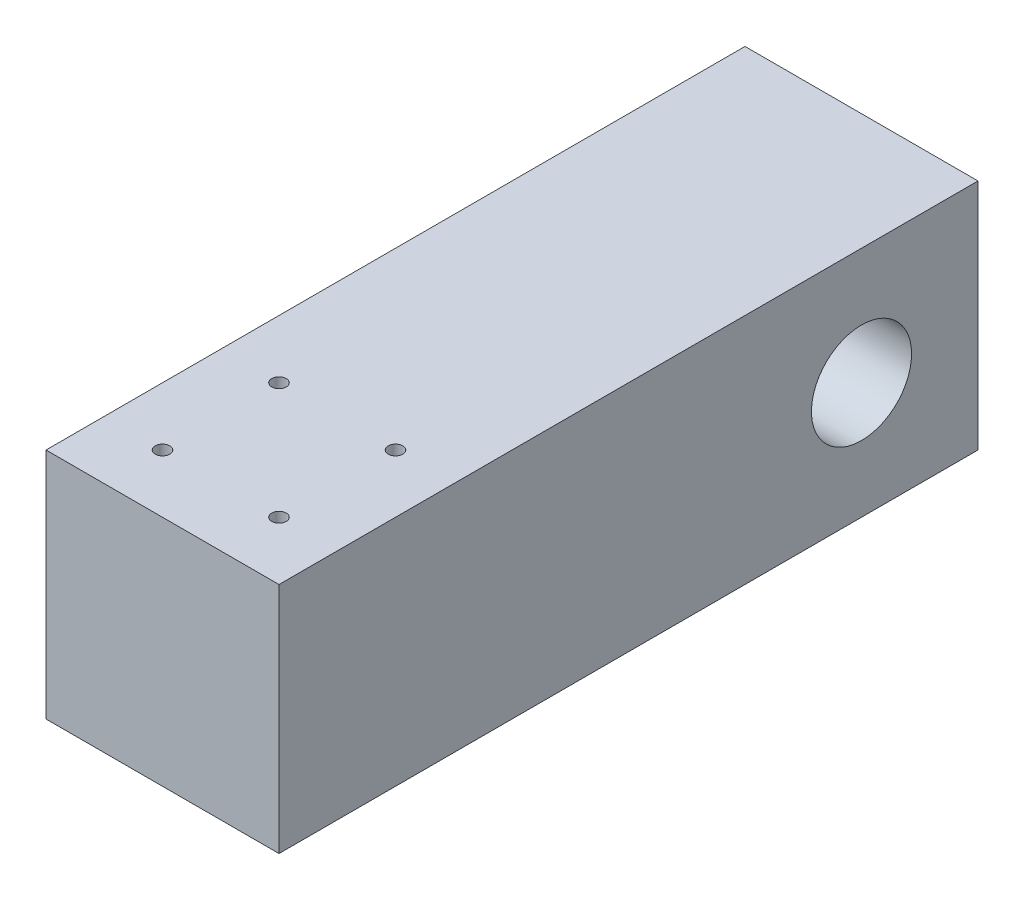
ISO-10303-21;
HEADER;
FILE_DESCRIPTION(('STEP AP214'),'2;1');
FILE_NAME('part.step','',(''),(''),'','','');
FILE_SCHEMA(('AUTOMOTIVE_DESIGN { 1 0 10303 214 1 1 1 1 }'));
ENDSEC;
DATA;
#1=APPLICATION_CONTEXT('core data for automotive mechanical design processes');
#2=APPLICATION_PROTOCOL_DEFINITION('international standard','automotive_design',2000,#1);
#3=PRODUCT_CONTEXT('',#1,'mechanical');
#4=PRODUCT('Part','Part','',(#3));
#5=PRODUCT_RELATED_PRODUCT_CATEGORY('part','',(#4));
#6=PRODUCT_DEFINITION_FORMATION('','',#4);
#7=PRODUCT_DEFINITION_CONTEXT('part definition',#1,'design');
#8=PRODUCT_DEFINITION('design','',#6,#7);
#9=PRODUCT_DEFINITION_SHAPE('','',#8);
#10=(LENGTH_UNIT() NAMED_UNIT(*) SI_UNIT(.MILLI.,.METRE.));
#11=(NAMED_UNIT(*) PLANE_ANGLE_UNIT() SI_UNIT($,.RADIAN.));
#12=(NAMED_UNIT(*) SI_UNIT($,.STERADIAN.) SOLID_ANGLE_UNIT());
#13=UNCERTAINTY_MEASURE_WITH_UNIT(LENGTH_MEASURE(1.E-05),#10,'distance_accuracy_value','');
#14=(GEOMETRIC_REPRESENTATION_CONTEXT(3) GLOBAL_UNCERTAINTY_ASSIGNED_CONTEXT((#13)) GLOBAL_UNIT_ASSIGNED_CONTEXT((#10,
#11,#12)) REPRESENTATION_CONTEXT('',''));
#15=CARTESIAN_POINT('',(0.,0.,0.));
#16=DIRECTION('',(0.,0.,1.));
#17=DIRECTION('',(1.,0.,0.));
#18=AXIS2_PLACEMENT_3D('',#15,#16,#17);
#19=CARTESIAN_POINT('',(50.8,0.,0.));
#20=DIRECTION('',(0.,0.,-1.));
#21=DIRECTION('',(-1.,0.,0.));
#22=AXIS2_PLACEMENT_3D('',#19,#20,#21);
#23=PLANE('',#22);
#24=DIRECTION('',(0.,-1.,0.));
#25=VECTOR('',#24,1.);
#26=CARTESIAN_POINT('',(0.,0.,0.));
#27=LINE('',#26,#25);
#28=CARTESIAN_POINT('',(0.,50.8,0.));
#29=VERTEX_POINT('',#28);
#30=CARTESIAN_POINT('',(0.,0.,0.));
#31=VERTEX_POINT('',#30);
#32=EDGE_CURVE('E97',#29,#31,#27,.T.);
#33=ORIENTED_EDGE('',*,*,#32,.T.);
#34=DIRECTION('',(-1.,0.,0.));
#35=VECTOR('',#34,1.);
#36=CARTESIAN_POINT('',(50.8,0.,0.));
#37=LINE('',#36,#35);
#38=CARTESIAN_POINT('',(50.8,0.,0.));
#39=VERTEX_POINT('',#38);
#40=EDGE_CURVE('E11',#39,#31,#37,.T.);
#41=ORIENTED_EDGE('',*,*,#40,.F.);
#42=DIRECTION('',(0.,-1.,0.));
#43=VECTOR('',#42,1.);
#44=CARTESIAN_POINT('',(50.8,0.,0.));
#45=LINE('',#44,#43);
#46=CARTESIAN_POINT('',(50.8,50.8,0.));
#47=VERTEX_POINT('',#46);
#48=EDGE_CURVE('E85',#47,#39,#45,.T.);
#49=ORIENTED_EDGE('',*,*,#48,.F.);
#50=DIRECTION('',(-1.,0.,0.));
#51=VECTOR('',#50,1.);
#52=CARTESIAN_POINT('',(50.8,50.8,0.));
#53=LINE('',#52,#51);
#54=EDGE_CURVE('E93',#47,#29,#53,.T.);
#55=ORIENTED_EDGE('',*,*,#54,.T.);
#56=EDGE_LOOP('',(#33,#41,#49,#55));
#57=FACE_BOUND('',#56,.T.);
#58=ADVANCED_FACE('F34',(#57),#23,.F.);
#59=CARTESIAN_POINT('',(50.8,0.,0.));
#60=DIRECTION('',(0.,1.,0.));
#61=DIRECTION('',(0.,0.,1.));
#62=AXIS2_PLACEMENT_3D('',#59,#60,#61);
#63=PLANE('',#62);
#64=CARTESIAN_POINT('',(38.1,0.,-38.1));
#65=DIRECTION('',(0.,1.,0.));
#66=DIRECTION('',(0.,0.,1.));
#67=AXIS2_PLACEMENT_3D('',#64,#65,#66);
#68=CIRCLE('',#67,1.5875);
#69=CARTESIAN_POINT('',(38.1,0.,-36.5125));
#70=VERTEX_POINT('',#69);
#71=EDGE_CURVE('E120',#70,#70,#68,.T.);
#72=ORIENTED_EDGE('',*,*,#71,.T.);
#73=EDGE_LOOP('',(#72));
#74=FACE_BOUND('',#73,.T.);
#75=CARTESIAN_POINT('',(12.7,0.,-12.7));
#76=DIRECTION('',(0.,1.,0.));
#77=DIRECTION('',(0.,0.,1.));
#78=AXIS2_PLACEMENT_3D('',#75,#76,#77);
#79=CIRCLE('',#78,1.5875);
#80=CARTESIAN_POINT('',(12.7,0.,-11.1125));
#81=VERTEX_POINT('',#80);
#82=EDGE_CURVE('E126',#81,#81,#79,.T.);
#83=ORIENTED_EDGE('',*,*,#82,.T.);
#84=EDGE_LOOP('',(#83));
#85=FACE_BOUND('',#84,.T.);
#86=CARTESIAN_POINT('',(38.1,0.,-12.7));
#87=DIRECTION('',(0.,1.,0.));
#88=DIRECTION('',(0.,0.,1.));
#89=AXIS2_PLACEMENT_3D('',#86,#87,#88);
#90=CIRCLE('',#89,1.5875);
#91=CARTESIAN_POINT('',(38.1,0.,-11.1125));
#92=VERTEX_POINT('',#91);
#93=EDGE_CURVE('E127',#92,#92,#90,.T.);
#94=ORIENTED_EDGE('',*,*,#93,.T.);
#95=EDGE_LOOP('',(#94));
#96=FACE_BOUND('',#95,.T.);
#97=CARTESIAN_POINT('',(12.7,0.,-38.1));
#98=DIRECTION('',(0.,1.,0.));
#99=DIRECTION('',(0.,0.,1.));
#100=AXIS2_PLACEMENT_3D('',#97,#98,#99);
#101=CIRCLE('',#100,1.5875);
#102=CARTESIAN_POINT('',(12.7,0.,-36.5125));
#103=VERTEX_POINT('',#102);
#104=EDGE_CURVE('E114',#103,#103,#101,.T.);
#105=ORIENTED_EDGE('',*,*,#104,.T.);
#106=EDGE_LOOP('',(#105));
#107=FACE_BOUND('',#106,.T.);
#108=DIRECTION('',(0.,0.,-1.));
#109=VECTOR('',#108,1.);
#110=CARTESIAN_POINT('',(0.,0.,0.));
#111=LINE('',#110,#109);
#112=CARTESIAN_POINT('',(0.,0.,-152.4));
#113=VERTEX_POINT('',#112);
#114=EDGE_CURVE('E89',#31,#113,#111,.T.);
#115=ORIENTED_EDGE('',*,*,#114,.T.);
#116=DIRECTION('',(-1.,0.,0.));
#117=VECTOR('',#116,1.);
#118=CARTESIAN_POINT('',(50.8,0.,-152.4));
#119=LINE('',#118,#117);
#120=CARTESIAN_POINT('',(50.8,0.,-152.4));
#121=VERTEX_POINT('',#120);
#122=EDGE_CURVE('E42',#121,#113,#119,.T.);
#123=ORIENTED_EDGE('',*,*,#122,.F.);
#124=DIRECTION('',(0.,0.,-1.));
#125=VECTOR('',#124,1.);
#126=CARTESIAN_POINT('',(50.8,0.,0.));
#127=LINE('',#126,#125);
#128=EDGE_CURVE('E80',#39,#121,#127,.T.);
#129=ORIENTED_EDGE('',*,*,#128,.F.);
#130=ORIENTED_EDGE('',*,*,#40,.T.);
#131=EDGE_LOOP('',(#115,#123,#129,#130));
#132=FACE_BOUND('',#131,.T.);
#133=ADVANCED_FACE('F88',(#74,#85,#96,#107,#132),#63,.F.);
#134=CARTESIAN_POINT('',(50.8,0.,-152.4));
#135=DIRECTION('',(0.,0.,1.));
#136=DIRECTION('',(1.,0.,0.));
#137=AXIS2_PLACEMENT_3D('',#134,#135,#136);
#138=PLANE('',#137);
#139=DIRECTION('',(0.,1.,0.));
#140=VECTOR('',#139,1.);
#141=CARTESIAN_POINT('',(0.,0.,-152.4));
#142=LINE('',#141,#140);
#143=CARTESIAN_POINT('',(0.,50.8,-152.4));
#144=VERTEX_POINT('',#143);
#145=EDGE_CURVE('E67',#113,#144,#142,.T.);
#146=ORIENTED_EDGE('',*,*,#145,.T.);
#147=DIRECTION('',(-1.,0.,0.));
#148=VECTOR('',#147,1.);
#149=CARTESIAN_POINT('',(50.8,50.8,-152.4));
#150=LINE('',#149,#148);
#151=CARTESIAN_POINT('',(50.8,50.8,-152.4));
#152=VERTEX_POINT('',#151);
#153=EDGE_CURVE('E90',#152,#144,#150,.T.);
#154=ORIENTED_EDGE('',*,*,#153,.F.);
#155=DIRECTION('',(0.,1.,0.));
#156=VECTOR('',#155,1.);
#157=CARTESIAN_POINT('',(50.8,0.,-152.4));
#158=LINE('',#157,#156);
#159=EDGE_CURVE('E83',#121,#152,#158,.T.);
#160=ORIENTED_EDGE('',*,*,#159,.F.);
#161=ORIENTED_EDGE('',*,*,#122,.T.);
#162=EDGE_LOOP('',(#146,#154,#160,#161));
#163=FACE_BOUND('',#162,.T.);
#164=ADVANCED_FACE('F91',(#163),#138,.F.);
#165=CARTESIAN_POINT('',(50.8,50.8,0.));
#166=DIRECTION('',(0.,-1.,0.));
#167=DIRECTION('',(0.,0.,-1.));
#168=AXIS2_PLACEMENT_3D('',#165,#166,#167);
#169=PLANE('',#168);
#170=CARTESIAN_POINT('',(38.1,50.8,-38.1));
#171=DIRECTION('',(0.,1.,0.));
#172=DIRECTION('',(0.,0.,1.));
#173=AXIS2_PLACEMENT_3D('',#170,#171,#172);
#174=CIRCLE('',#173,1.5875);
#175=CARTESIAN_POINT('',(38.1,50.8,-36.5125));
#176=VERTEX_POINT('',#175);
#177=EDGE_CURVE('E130',#176,#176,#174,.T.);
#178=ORIENTED_EDGE('',*,*,#177,.F.);
#179=EDGE_LOOP('',(#178));
#180=FACE_BOUND('',#179,.T.);
#181=CARTESIAN_POINT('',(12.7,50.8,-12.7));
#182=DIRECTION('',(0.,1.,0.));
#183=DIRECTION('',(0.,0.,1.));
#184=AXIS2_PLACEMENT_3D('',#181,#182,#183);
#185=CIRCLE('',#184,1.5875);
#186=CARTESIAN_POINT('',(12.7,50.8,-11.1125));
#187=VERTEX_POINT('',#186);
#188=EDGE_CURVE('E123',#187,#187,#185,.T.);
#189=ORIENTED_EDGE('',*,*,#188,.F.);
#190=EDGE_LOOP('',(#189));
#191=FACE_BOUND('',#190,.T.);
#192=CARTESIAN_POINT('',(38.1,50.8,-12.7));
#193=DIRECTION('',(0.,1.,0.));
#194=DIRECTION('',(0.,0.,1.));
#195=AXIS2_PLACEMENT_3D('',#192,#193,#194);
#196=CIRCLE('',#195,1.5875);
#197=CARTESIAN_POINT('',(38.1,50.8,-11.1125));
#198=VERTEX_POINT('',#197);
#199=EDGE_CURVE('E135',#198,#198,#196,.T.);
#200=ORIENTED_EDGE('',*,*,#199,.F.);
#201=EDGE_LOOP('',(#200));
#202=FACE_BOUND('',#201,.T.);
#203=CARTESIAN_POINT('',(12.7,50.8,-38.1));
#204=DIRECTION('',(0.,1.,0.));
#205=DIRECTION('',(0.,0.,1.));
#206=AXIS2_PLACEMENT_3D('',#203,#204,#205);
#207=CIRCLE('',#206,1.5875);
#208=CARTESIAN_POINT('',(12.7,50.8,-36.5125));
#209=VERTEX_POINT('',#208);
#210=EDGE_CURVE('E117',#209,#209,#207,.T.);
#211=ORIENTED_EDGE('',*,*,#210,.F.);
#212=EDGE_LOOP('',(#211));
#213=FACE_BOUND('',#212,.T.);
#214=DIRECTION('',(0.,0.,1.));
#215=VECTOR('',#214,1.);
#216=CARTESIAN_POINT('',(0.,50.8,0.));
#217=LINE('',#216,#215);
#218=EDGE_CURVE('E73',#144,#29,#217,.T.);
#219=ORIENTED_EDGE('',*,*,#218,.T.);
#220=ORIENTED_EDGE('',*,*,#54,.F.);
#221=DIRECTION('',(0.,0.,1.));
#222=VECTOR('',#221,1.);
#223=CARTESIAN_POINT('',(50.8,50.8,0.));
#224=LINE('',#223,#222);
#225=EDGE_CURVE('E50',#152,#47,#224,.T.);
#226=ORIENTED_EDGE('',*,*,#225,.F.);
#227=ORIENTED_EDGE('',*,*,#153,.T.);
#228=EDGE_LOOP('',(#219,#220,#226,#227));
#229=FACE_BOUND('',#228,.T.);
#230=ADVANCED_FACE('F105',(#180,#191,#202,#213,#229),#169,.F.);
#231=CARTESIAN_POINT('',(50.8,0.,0.));
#232=DIRECTION('',(-1.,0.,0.));
#233=DIRECTION('',(0.,0.,1.));
#234=AXIS2_PLACEMENT_3D('',#231,#232,#233);
#235=PLANE('',#234);
#236=CARTESIAN_POINT('',(50.8,25.4,-127.));
#237=DIRECTION('',(1.,0.,0.));
#238=DIRECTION('',(0.,0.,-1.));
#239=AXIS2_PLACEMENT_3D('',#236,#237,#238);
#240=CIRCLE('',#239,10.9140625);
#241=CARTESIAN_POINT('',(50.8,25.4,-137.9140625));
#242=VERTEX_POINT('',#241);
#243=EDGE_CURVE('E111',#242,#242,#240,.T.);
#244=ORIENTED_EDGE('',*,*,#243,.F.);
#245=EDGE_LOOP('',(#244));
#246=FACE_BOUND('',#245,.T.);
#247=ORIENTED_EDGE('',*,*,#48,.T.);
#248=ORIENTED_EDGE('',*,*,#128,.T.);
#249=ORIENTED_EDGE('',*,*,#159,.T.);
#250=ORIENTED_EDGE('',*,*,#225,.T.);
#251=EDGE_LOOP('',(#247,#248,#249,#250));
#252=FACE_BOUND('',#251,.T.);
#253=ADVANCED_FACE('F81',(#246,#252),#235,.F.);
#254=CARTESIAN_POINT('',(0.,0.,0.));
#255=DIRECTION('',(-1.,0.,0.));
#256=DIRECTION('',(0.,0.,1.));
#257=AXIS2_PLACEMENT_3D('',#254,#255,#256);
#258=PLANE('',#257);
#259=CARTESIAN_POINT('',(0.,25.4,-127.));
#260=DIRECTION('',(1.,0.,0.));
#261=DIRECTION('',(0.,0.,-1.));
#262=AXIS2_PLACEMENT_3D('',#259,#260,#261);
#263=CIRCLE('',#262,10.9140625);
#264=CARTESIAN_POINT('',(0.,25.4,-137.9140625));
#265=VERTEX_POINT('',#264);
#266=EDGE_CURVE('E100',#265,#265,#263,.T.);
#267=ORIENTED_EDGE('',*,*,#266,.T.);
#268=EDGE_LOOP('',(#267));
#269=FACE_BOUND('',#268,.T.);
#270=ORIENTED_EDGE('',*,*,#32,.F.);
#271=ORIENTED_EDGE('',*,*,#218,.F.);
#272=ORIENTED_EDGE('',*,*,#145,.F.);
#273=ORIENTED_EDGE('',*,*,#114,.F.);
#274=EDGE_LOOP('',(#270,#271,#272,#273));
#275=FACE_BOUND('',#274,.T.);
#276=ADVANCED_FACE('F108',(#269,#275),#258,.T.);
#277=CARTESIAN_POINT('',(0.,25.4,-127.));
#278=DIRECTION('',(1.,0.,0.));
#279=DIRECTION('',(0.,0.,-1.));
#280=AXIS2_PLACEMENT_3D('',#277,#278,#279);
#281=CYLINDRICAL_SURFACE('',#280,10.9140625);
#282=ORIENTED_EDGE('',*,*,#266,.F.);
#283=EDGE_LOOP('',(#282));
#284=FACE_BOUND('',#283,.T.);
#285=ORIENTED_EDGE('',*,*,#243,.T.);
#286=EDGE_LOOP('',(#285));
#287=FACE_BOUND('',#286,.T.);
#288=ADVANCED_FACE('F158',(#284,#287),#281,.F.);
#289=CARTESIAN_POINT('',(12.7,0.,-38.1));
#290=DIRECTION('',(0.,1.,0.));
#291=DIRECTION('',(0.,0.,1.));
#292=AXIS2_PLACEMENT_3D('',#289,#290,#291);
#293=CYLINDRICAL_SURFACE('',#292,1.5875);
#294=ORIENTED_EDGE('',*,*,#104,.F.);
#295=EDGE_LOOP('',(#294));
#296=FACE_BOUND('',#295,.T.);
#297=ORIENTED_EDGE('',*,*,#210,.T.);
#298=EDGE_LOOP('',(#297));
#299=FACE_BOUND('',#298,.T.);
#300=ADVANCED_FACE('F147',(#296,#299),#293,.F.);
#301=CARTESIAN_POINT('',(38.1,0.,-12.7));
#302=DIRECTION('',(0.,1.,0.));
#303=DIRECTION('',(0.,0.,1.));
#304=AXIS2_PLACEMENT_3D('',#301,#302,#303);
#305=CYLINDRICAL_SURFACE('',#304,1.5875);
#306=ORIENTED_EDGE('',*,*,#93,.F.);
#307=EDGE_LOOP('',(#306));
#308=FACE_BOUND('',#307,.T.);
#309=ORIENTED_EDGE('',*,*,#199,.T.);
#310=EDGE_LOOP('',(#309));
#311=FACE_BOUND('',#310,.T.);
#312=ADVANCED_FACE('F143',(#308,#311),#305,.F.);
#313=CARTESIAN_POINT('',(12.7,0.,-12.7));
#314=DIRECTION('',(0.,1.,0.));
#315=DIRECTION('',(0.,0.,1.));
#316=AXIS2_PLACEMENT_3D('',#313,#314,#315);
#317=CYLINDRICAL_SURFACE('',#316,1.5875);
#318=ORIENTED_EDGE('',*,*,#82,.F.);
#319=EDGE_LOOP('',(#318));
#320=FACE_BOUND('',#319,.T.);
#321=ORIENTED_EDGE('',*,*,#188,.T.);
#322=EDGE_LOOP('',(#321));
#323=FACE_BOUND('',#322,.T.);
#324=ADVANCED_FACE('F146',(#320,#323),#317,.F.);
#325=CARTESIAN_POINT('',(38.1,0.,-38.1));
#326=DIRECTION('',(0.,1.,0.));
#327=DIRECTION('',(0.,0.,1.));
#328=AXIS2_PLACEMENT_3D('',#325,#326,#327);
#329=CYLINDRICAL_SURFACE('',#328,1.5875);
#330=ORIENTED_EDGE('',*,*,#71,.F.);
#331=EDGE_LOOP('',(#330));
#332=FACE_BOUND('',#331,.T.);
#333=ORIENTED_EDGE('',*,*,#177,.T.);
#334=EDGE_LOOP('',(#333));
#335=FACE_BOUND('',#334,.T.);
#336=ADVANCED_FACE('F217',(#332,#335),#329,.F.);
#337=CLOSED_SHELL('',(#58,#133,#164,#230,#253,#276,#288,#300,#312,#324,#336));
#338=MANIFOLD_SOLID_BREP('B2',#337);
#339=ADVANCED_BREP_SHAPE_REPRESENTATION('',(#18,#338),#14);
#340=SHAPE_DEFINITION_REPRESENTATION(#9,#339);
ENDSEC;
END-ISO-10303-21;
